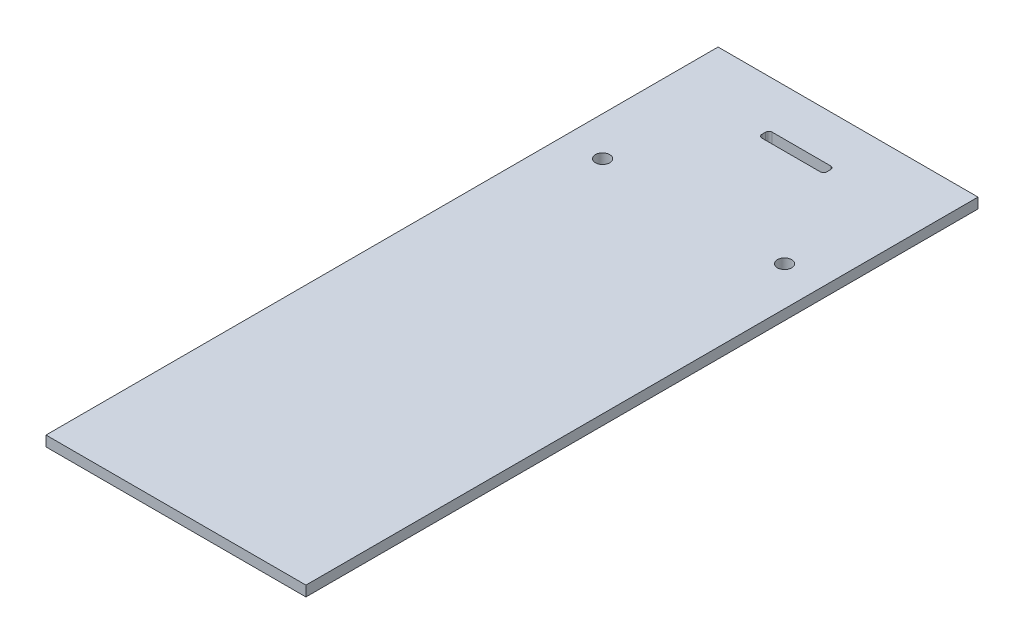
ISO-10303-21;
HEADER;
FILE_DESCRIPTION(('STEP AP214'),'2;1');
FILE_NAME('part.step','',(''),(''),'','','');
FILE_SCHEMA(('AUTOMOTIVE_DESIGN { 1 0 10303 214 1 1 1 1 }'));
ENDSEC;
DATA;
#1=APPLICATION_CONTEXT('core data for automotive mechanical design processes');
#2=APPLICATION_PROTOCOL_DEFINITION('international standard','automotive_design',2000,#1);
#3=PRODUCT_CONTEXT('',#1,'mechanical');
#4=PRODUCT('Part','Part','',(#3));
#5=PRODUCT_RELATED_PRODUCT_CATEGORY('part','',(#4));
#6=PRODUCT_DEFINITION_FORMATION('','',#4);
#7=PRODUCT_DEFINITION_CONTEXT('part definition',#1,'design');
#8=PRODUCT_DEFINITION('design','',#6,#7);
#9=PRODUCT_DEFINITION_SHAPE('','',#8);
#10=(LENGTH_UNIT() NAMED_UNIT(*) SI_UNIT(.MILLI.,.METRE.));
#11=(NAMED_UNIT(*) PLANE_ANGLE_UNIT() SI_UNIT($,.RADIAN.));
#12=(NAMED_UNIT(*) SI_UNIT($,.STERADIAN.) SOLID_ANGLE_UNIT());
#13=UNCERTAINTY_MEASURE_WITH_UNIT(LENGTH_MEASURE(1.E-05),#10,'distance_accuracy_value','');
#14=(GEOMETRIC_REPRESENTATION_CONTEXT(3) GLOBAL_UNCERTAINTY_ASSIGNED_CONTEXT((#13)) GLOBAL_UNIT_ASSIGNED_CONTEXT((#10,
#11,#12)) REPRESENTATION_CONTEXT('',''));
#15=CARTESIAN_POINT('',(0.,0.,0.));
#16=DIRECTION('',(0.,0.,1.));
#17=DIRECTION('',(1.,0.,0.));
#18=AXIS2_PLACEMENT_3D('',#15,#16,#17);
#19=CARTESIAN_POINT('',(40.,3.175,103.425));
#20=DIRECTION('',(-1.,0.,0.));
#21=DIRECTION('',(0.,0.,1.));
#22=AXIS2_PLACEMENT_3D('',#19,#20,#21);
#23=PLANE('',#22);
#24=DIRECTION('',(0.,0.,-1.));
#25=VECTOR('',#24,1.);
#26=CARTESIAN_POINT('',(40.,0.,103.425));
#27=LINE('',#26,#25);
#28=CARTESIAN_POINT('',(40.,0.,103.425));
#29=VERTEX_POINT('',#28);
#30=CARTESIAN_POINT('',(40.,0.,-103.425));
#31=VERTEX_POINT('',#30);
#32=EDGE_CURVE('E160',#29,#31,#27,.T.);
#33=ORIENTED_EDGE('',*,*,#32,.T.);
#34=DIRECTION('',(0.,-1.,0.));
#35=VECTOR('',#34,1.);
#36=CARTESIAN_POINT('',(40.,3.175,-103.425));
#37=LINE('',#36,#35);
#38=CARTESIAN_POINT('',(40.,3.175,-103.425));
#39=VERTEX_POINT('',#38);
#40=EDGE_CURVE('E139',#39,#31,#37,.T.);
#41=ORIENTED_EDGE('',*,*,#40,.F.);
#42=DIRECTION('',(0.,0.,-1.));
#43=VECTOR('',#42,1.);
#44=CARTESIAN_POINT('',(40.,3.175,103.425));
#45=LINE('',#44,#43);
#46=CARTESIAN_POINT('',(40.,3.175,103.425));
#47=VERTEX_POINT('',#46);
#48=EDGE_CURVE('E147',#47,#39,#45,.T.);
#49=ORIENTED_EDGE('',*,*,#48,.F.);
#50=DIRECTION('',(0.,-1.,0.));
#51=VECTOR('',#50,1.);
#52=CARTESIAN_POINT('',(40.,3.175,103.425));
#53=LINE('',#52,#51);
#54=EDGE_CURVE('E277',#47,#29,#53,.T.);
#55=ORIENTED_EDGE('',*,*,#54,.T.);
#56=EDGE_LOOP('',(#33,#41,#49,#55));
#57=FACE_BOUND('',#56,.T.);
#58=ADVANCED_FACE('F45',(#57),#23,.F.);
#59=CARTESIAN_POINT('',(-40.,3.175,-103.425));
#60=DIRECTION('',(0.,0.,1.));
#61=DIRECTION('',(1.,0.,0.));
#62=AXIS2_PLACEMENT_3D('',#59,#60,#61);
#63=PLANE('',#62);
#64=DIRECTION('',(-1.,0.,0.));
#65=VECTOR('',#64,1.);
#66=CARTESIAN_POINT('',(-40.,0.,-103.425));
#67=LINE('',#66,#65);
#68=CARTESIAN_POINT('',(-40.,0.,-103.425));
#69=VERTEX_POINT('',#68);
#70=EDGE_CURVE('E280',#31,#69,#67,.T.);
#71=ORIENTED_EDGE('',*,*,#70,.T.);
#72=DIRECTION('',(0.,-1.,0.));
#73=VECTOR('',#72,1.);
#74=CARTESIAN_POINT('',(-40.,3.175,-103.425));
#75=LINE('',#74,#73);
#76=CARTESIAN_POINT('',(-40.,3.175,-103.425));
#77=VERTEX_POINT('',#76);
#78=EDGE_CURVE('E142',#77,#69,#75,.T.);
#79=ORIENTED_EDGE('',*,*,#78,.F.);
#80=DIRECTION('',(-1.,0.,0.));
#81=VECTOR('',#80,1.);
#82=CARTESIAN_POINT('',(-40.,3.175,-103.425));
#83=LINE('',#82,#81);
#84=EDGE_CURVE('E135',#39,#77,#83,.T.);
#85=ORIENTED_EDGE('',*,*,#84,.F.);
#86=ORIENTED_EDGE('',*,*,#40,.T.);
#87=EDGE_LOOP('',(#71,#79,#85,#86));
#88=FACE_BOUND('',#87,.T.);
#89=ADVANCED_FACE('F137',(#88),#63,.F.);
#90=CARTESIAN_POINT('',(-40.,3.175,103.425));
#91=DIRECTION('',(1.,0.,0.));
#92=DIRECTION('',(0.,0.,-1.));
#93=AXIS2_PLACEMENT_3D('',#90,#91,#92);
#94=PLANE('',#93);
#95=DIRECTION('',(0.,0.,1.));
#96=VECTOR('',#95,1.);
#97=CARTESIAN_POINT('',(-40.,0.,103.425));
#98=LINE('',#97,#96);
#99=CARTESIAN_POINT('',(-40.,0.,103.425));
#100=VERTEX_POINT('',#99);
#101=EDGE_CURVE('E283',#69,#100,#98,.T.);
#102=ORIENTED_EDGE('',*,*,#101,.T.);
#103=DIRECTION('',(0.,-1.,0.));
#104=VECTOR('',#103,1.);
#105=CARTESIAN_POINT('',(-40.,3.175,103.425));
#106=LINE('',#105,#104);
#107=CARTESIAN_POINT('',(-40.,3.175,103.425));
#108=VERTEX_POINT('',#107);
#109=EDGE_CURVE('E168',#108,#100,#106,.T.);
#110=ORIENTED_EDGE('',*,*,#109,.F.);
#111=DIRECTION('',(0.,0.,1.));
#112=VECTOR('',#111,1.);
#113=CARTESIAN_POINT('',(-40.,3.175,103.425));
#114=LINE('',#113,#112);
#115=EDGE_CURVE('E146',#77,#108,#114,.T.);
#116=ORIENTED_EDGE('',*,*,#115,.F.);
#117=ORIENTED_EDGE('',*,*,#78,.T.);
#118=EDGE_LOOP('',(#102,#110,#116,#117));
#119=FACE_BOUND('',#118,.T.);
#120=ADVANCED_FACE('F299',(#119),#94,.F.);
#121=CARTESIAN_POINT('',(-40.,3.175,103.425));
#122=DIRECTION('',(0.,0.,-1.));
#123=DIRECTION('',(-1.,0.,0.));
#124=AXIS2_PLACEMENT_3D('',#121,#122,#123);
#125=PLANE('',#124);
#126=DIRECTION('',(1.,0.,0.));
#127=VECTOR('',#126,1.);
#128=CARTESIAN_POINT('',(-40.,0.,103.425));
#129=LINE('',#128,#127);
#130=EDGE_CURVE('E157',#100,#29,#129,.T.);
#131=ORIENTED_EDGE('',*,*,#130,.T.);
#132=ORIENTED_EDGE('',*,*,#54,.F.);
#133=DIRECTION('',(1.,0.,0.));
#134=VECTOR('',#133,1.);
#135=CARTESIAN_POINT('',(-40.,3.175,103.425));
#136=LINE('',#135,#134);
#137=EDGE_CURVE('E152',#108,#47,#136,.T.);
#138=ORIENTED_EDGE('',*,*,#137,.F.);
#139=ORIENTED_EDGE('',*,*,#109,.T.);
#140=EDGE_LOOP('',(#131,#132,#138,#139));
#141=FACE_BOUND('',#140,.T.);
#142=ADVANCED_FACE('F294',(#141),#125,.F.);
#143=CARTESIAN_POINT('',(0.,3.175,0.));
#144=DIRECTION('',(0.,-1.,0.));
#145=DIRECTION('',(0.,0.,-1.));
#146=AXIS2_PLACEMENT_3D('',#143,#144,#145);
#147=PLANE('',#146);
#148=DIRECTION('',(-1.,0.,0.));
#149=VECTOR('',#148,1.);
#150=CARTESIAN_POINT('',(-10.,3.175,-89.0578365013378));
#151=LINE('',#150,#149);
#152=CARTESIAN_POINT('',(9.,3.175,-89.0578365013378));
#153=VERTEX_POINT('',#152);
#154=CARTESIAN_POINT('',(-9.,3.175,-89.0578365013378));
#155=VERTEX_POINT('',#154);
#156=EDGE_CURVE('E250',#153,#155,#151,.T.);
#157=ORIENTED_EDGE('',*,*,#156,.F.);
#158=CARTESIAN_POINT('',(9.,3.175,-88.0578365013378));
#159=DIRECTION('',(0.,-1.,0.));
#160=DIRECTION('',(0.,0.,-1.));
#161=AXIS2_PLACEMENT_3D('',#158,#159,#160);
#162=CIRCLE('',#161,1.);
#163=CARTESIAN_POINT('',(10.,3.175,-88.0578365013378));
#164=VERTEX_POINT('',#163);
#165=EDGE_CURVE('E207',#153,#164,#162,.T.);
#166=ORIENTED_EDGE('',*,*,#165,.T.);
#167=DIRECTION('',(0.,0.,-1.));
#168=VECTOR('',#167,1.);
#169=CARTESIAN_POINT('',(10.,3.175,-85.8828365013378));
#170=LINE('',#169,#168);
#171=CARTESIAN_POINT('',(10.,3.175,-86.8828365013378));
#172=VERTEX_POINT('',#171);
#173=EDGE_CURVE('E220',#172,#164,#170,.T.);
#174=ORIENTED_EDGE('',*,*,#173,.F.);
#175=CARTESIAN_POINT('',(9.,3.175,-86.8828365013378));
#176=DIRECTION('',(0.,-1.,0.));
#177=DIRECTION('',(0.,0.,-1.));
#178=AXIS2_PLACEMENT_3D('',#175,#176,#177);
#179=CIRCLE('',#178,1.);
#180=CARTESIAN_POINT('',(9.,3.175,-85.8828365013378));
#181=VERTEX_POINT('',#180);
#182=EDGE_CURVE('E54',#172,#181,#179,.T.);
#183=ORIENTED_EDGE('',*,*,#182,.T.);
#184=DIRECTION('',(1.,0.,0.));
#185=VECTOR('',#184,1.);
#186=CARTESIAN_POINT('',(-10.,3.175,-85.8828365013378));
#187=LINE('',#186,#185);
#188=CARTESIAN_POINT('',(-9.,3.175,-85.8828365013378));
#189=VERTEX_POINT('',#188);
#190=EDGE_CURVE('E219',#189,#181,#187,.T.);
#191=ORIENTED_EDGE('',*,*,#190,.F.);
#192=CARTESIAN_POINT('',(-9.,3.175,-86.8828365013378));
#193=DIRECTION('',(0.,-1.,0.));
#194=DIRECTION('',(0.,0.,-1.));
#195=AXIS2_PLACEMENT_3D('',#192,#193,#194);
#196=CIRCLE('',#195,1.);
#197=CARTESIAN_POINT('',(-10.,3.175,-86.8828365013378));
#198=VERTEX_POINT('',#197);
#199=EDGE_CURVE('E195',#189,#198,#196,.T.);
#200=ORIENTED_EDGE('',*,*,#199,.T.);
#201=DIRECTION('',(0.,0.,1.));
#202=VECTOR('',#201,1.);
#203=CARTESIAN_POINT('',(-10.,3.175,-85.8828365013378));
#204=LINE('',#203,#202);
#205=CARTESIAN_POINT('',(-10.,3.175,-88.0578365013378));
#206=VERTEX_POINT('',#205);
#207=EDGE_CURVE('E230',#206,#198,#204,.T.);
#208=ORIENTED_EDGE('',*,*,#207,.F.);
#209=CARTESIAN_POINT('',(-9.,3.175,-88.0578365013378));
#210=DIRECTION('',(0.,-1.,0.));
#211=DIRECTION('',(0.,0.,-1.));
#212=AXIS2_PLACEMENT_3D('',#209,#210,#211);
#213=CIRCLE('',#212,1.);
#214=EDGE_CURVE('E201',#206,#155,#213,.T.);
#215=ORIENTED_EDGE('',*,*,#214,.T.);
#216=EDGE_LOOP('',(#157,#166,#174,#183,#191,#200,#208,#215));
#217=FACE_BOUND('',#216,.T.);
#218=CARTESIAN_POINT('',(28.,3.175,-55.8828365013378));
#219=DIRECTION('',(0.,1.,0.));
#220=DIRECTION('',(0.,0.,1.));
#221=AXIS2_PLACEMENT_3D('',#218,#219,#220);
#222=CIRCLE('',#221,2.2);
#223=CARTESIAN_POINT('',(28.,3.175,-53.6828365013378));
#224=VERTEX_POINT('',#223);
#225=EDGE_CURVE('E251',#224,#224,#222,.T.);
#226=ORIENTED_EDGE('',*,*,#225,.F.);
#227=EDGE_LOOP('',(#226));
#228=FACE_BOUND('',#227,.T.);
#229=CARTESIAN_POINT('',(-28.,3.175,-55.8828365013378));
#230=DIRECTION('',(0.,1.,0.));
#231=DIRECTION('',(0.,0.,-1.));
#232=AXIS2_PLACEMENT_3D('',#229,#230,#231);
#233=CIRCLE('',#232,2.20000000000001);
#234=CARTESIAN_POINT('',(-28.,3.175,-58.0828365013378));
#235=VERTEX_POINT('',#234);
#236=EDGE_CURVE('E265',#235,#235,#233,.T.);
#237=ORIENTED_EDGE('',*,*,#236,.F.);
#238=EDGE_LOOP('',(#237));
#239=FACE_BOUND('',#238,.T.);
#240=ORIENTED_EDGE('',*,*,#48,.T.);
#241=ORIENTED_EDGE('',*,*,#84,.T.);
#242=ORIENTED_EDGE('',*,*,#115,.T.);
#243=ORIENTED_EDGE('',*,*,#137,.T.);
#244=EDGE_LOOP('',(#240,#241,#242,#243));
#245=FACE_BOUND('',#244,.T.);
#246=ADVANCED_FACE('F150',(#217,#228,#239,#245),#147,.F.);
#247=CARTESIAN_POINT('',(0.,0.,0.));
#248=DIRECTION('',(0.,-1.,0.));
#249=DIRECTION('',(0.,0.,-1.));
#250=AXIS2_PLACEMENT_3D('',#247,#248,#249);
#251=PLANE('',#250);
#252=DIRECTION('',(1.,0.,0.));
#253=VECTOR('',#252,1.);
#254=CARTESIAN_POINT('',(-10.,0.,-85.8828365013378));
#255=LINE('',#254,#253);
#256=CARTESIAN_POINT('',(-9.,0.,-85.8828365013378));
#257=VERTEX_POINT('',#256);
#258=CARTESIAN_POINT('',(9.,0.,-85.8828365013378));
#259=VERTEX_POINT('',#258);
#260=EDGE_CURVE('E245',#257,#259,#255,.T.);
#261=ORIENTED_EDGE('',*,*,#260,.T.);
#262=CARTESIAN_POINT('',(9.,0.,-86.8828365013378));
#263=DIRECTION('',(0.,-1.,0.));
#264=DIRECTION('',(0.,0.,-1.));
#265=AXIS2_PLACEMENT_3D('',#262,#263,#264);
#266=CIRCLE('',#265,1.);
#267=CARTESIAN_POINT('',(10.,0.,-86.8828365013378));
#268=VERTEX_POINT('',#267);
#269=EDGE_CURVE('E11',#259,#268,#266,.F.);
#270=ORIENTED_EDGE('',*,*,#269,.T.);
#271=DIRECTION('',(0.,0.,-1.));
#272=VECTOR('',#271,1.);
#273=CARTESIAN_POINT('',(10.,0.,-85.8828365013378));
#274=LINE('',#273,#272);
#275=CARTESIAN_POINT('',(10.,0.,-88.0578365013378));
#276=VERTEX_POINT('',#275);
#277=EDGE_CURVE('E229',#268,#276,#274,.T.);
#278=ORIENTED_EDGE('',*,*,#277,.T.);
#279=CARTESIAN_POINT('',(9.,0.,-88.0578365013378));
#280=DIRECTION('',(0.,-1.,0.));
#281=DIRECTION('',(0.,0.,-1.));
#282=AXIS2_PLACEMENT_3D('',#279,#280,#281);
#283=CIRCLE('',#282,1.);
#284=CARTESIAN_POINT('',(9.,0.,-89.0578365013378));
#285=VERTEX_POINT('',#284);
#286=EDGE_CURVE('E210',#276,#285,#283,.F.);
#287=ORIENTED_EDGE('',*,*,#286,.T.);
#288=DIRECTION('',(-1.,0.,0.));
#289=VECTOR('',#288,1.);
#290=CARTESIAN_POINT('',(-10.,0.,-89.0578365013378));
#291=LINE('',#290,#289);
#292=CARTESIAN_POINT('',(-9.,0.,-89.0578365013378));
#293=VERTEX_POINT('',#292);
#294=EDGE_CURVE('E235',#285,#293,#291,.T.);
#295=ORIENTED_EDGE('',*,*,#294,.T.);
#296=CARTESIAN_POINT('',(-9.,0.,-88.0578365013378));
#297=DIRECTION('',(0.,-1.,0.));
#298=DIRECTION('',(0.,0.,-1.));
#299=AXIS2_PLACEMENT_3D('',#296,#297,#298);
#300=CIRCLE('',#299,1.);
#301=CARTESIAN_POINT('',(-10.,0.,-88.0578365013378));
#302=VERTEX_POINT('',#301);
#303=EDGE_CURVE('E204',#293,#302,#300,.F.);
#304=ORIENTED_EDGE('',*,*,#303,.T.);
#305=DIRECTION('',(0.,0.,1.));
#306=VECTOR('',#305,1.);
#307=CARTESIAN_POINT('',(-10.,0.,-85.8828365013378));
#308=LINE('',#307,#306);
#309=CARTESIAN_POINT('',(-10.,0.,-86.8828365013378));
#310=VERTEX_POINT('',#309);
#311=EDGE_CURVE('E239',#302,#310,#308,.T.);
#312=ORIENTED_EDGE('',*,*,#311,.T.);
#313=CARTESIAN_POINT('',(-9.,0.,-86.8828365013378));
#314=DIRECTION('',(0.,-1.,0.));
#315=DIRECTION('',(0.,0.,-1.));
#316=AXIS2_PLACEMENT_3D('',#313,#314,#315);
#317=CIRCLE('',#316,1.);
#318=EDGE_CURVE('E198',#310,#257,#317,.F.);
#319=ORIENTED_EDGE('',*,*,#318,.T.);
#320=EDGE_LOOP('',(#261,#270,#278,#287,#295,#304,#312,#319));
#321=FACE_BOUND('',#320,.T.);
#322=CARTESIAN_POINT('',(28.,0.,-55.8828365013378));
#323=DIRECTION('',(0.,1.,0.));
#324=DIRECTION('',(0.,0.,1.));
#325=AXIS2_PLACEMENT_3D('',#322,#323,#324);
#326=CIRCLE('',#325,2.2);
#327=CARTESIAN_POINT('',(28.,0.,-53.6828365013378));
#328=VERTEX_POINT('',#327);
#329=EDGE_CURVE('E261',#328,#328,#326,.T.);
#330=ORIENTED_EDGE('',*,*,#329,.T.);
#331=EDGE_LOOP('',(#330));
#332=FACE_BOUND('',#331,.T.);
#333=CARTESIAN_POINT('',(-28.,0.,-55.8828365013378));
#334=DIRECTION('',(0.,1.,0.));
#335=DIRECTION('',(0.,0.,-1.));
#336=AXIS2_PLACEMENT_3D('',#333,#334,#335);
#337=CIRCLE('',#336,2.20000000000001);
#338=CARTESIAN_POINT('',(-28.,0.,-58.0828365013378));
#339=VERTEX_POINT('',#338);
#340=EDGE_CURVE('E269',#339,#339,#337,.T.);
#341=ORIENTED_EDGE('',*,*,#340,.T.);
#342=EDGE_LOOP('',(#341));
#343=FACE_BOUND('',#342,.T.);
#344=ORIENTED_EDGE('',*,*,#32,.F.);
#345=ORIENTED_EDGE('',*,*,#130,.F.);
#346=ORIENTED_EDGE('',*,*,#101,.F.);
#347=ORIENTED_EDGE('',*,*,#70,.F.);
#348=EDGE_LOOP('',(#344,#345,#346,#347));
#349=FACE_BOUND('',#348,.T.);
#350=ADVANCED_FACE('F298',(#321,#332,#343,#349),#251,.T.);
#351=CARTESIAN_POINT('',(-28.,0.,-55.8828365013378));
#352=DIRECTION('',(0.,1.,0.));
#353=DIRECTION('',(0.,0.,1.));
#354=AXIS2_PLACEMENT_3D('',#351,#352,#353);
#355=CYLINDRICAL_SURFACE('',#354,2.20000000000001);
#356=ORIENTED_EDGE('',*,*,#340,.F.);
#357=EDGE_LOOP('',(#356));
#358=FACE_BOUND('',#357,.T.);
#359=ORIENTED_EDGE('',*,*,#236,.T.);
#360=EDGE_LOOP('',(#359));
#361=FACE_BOUND('',#360,.T.);
#362=ADVANCED_FACE('F354',(#358,#361),#355,.F.);
#363=CARTESIAN_POINT('',(28.,0.,-55.8828365013378));
#364=DIRECTION('',(0.,1.,0.));
#365=DIRECTION('',(0.,0.,1.));
#366=AXIS2_PLACEMENT_3D('',#363,#364,#365);
#367=CYLINDRICAL_SURFACE('',#366,2.2);
#368=ORIENTED_EDGE('',*,*,#329,.F.);
#369=EDGE_LOOP('',(#368));
#370=FACE_BOUND('',#369,.T.);
#371=ORIENTED_EDGE('',*,*,#225,.T.);
#372=EDGE_LOOP('',(#371));
#373=FACE_BOUND('',#372,.T.);
#374=ADVANCED_FACE('F351',(#370,#373),#367,.F.);
#375=CARTESIAN_POINT('',(10.,0.,-85.8828365013378));
#376=DIRECTION('',(1.,0.,0.));
#377=DIRECTION('',(0.,0.,-1.));
#378=AXIS2_PLACEMENT_3D('',#375,#376,#377);
#379=PLANE('',#378);
#380=ORIENTED_EDGE('',*,*,#173,.T.);
#381=DIRECTION('',(0.,1.,0.));
#382=VECTOR('',#381,1.);
#383=CARTESIAN_POINT('',(10.,0.,-88.0578365013378));
#384=LINE('',#383,#382);
#385=EDGE_CURVE('E61',#164,#276,#384,.F.);
#386=ORIENTED_EDGE('',*,*,#385,.T.);
#387=ORIENTED_EDGE('',*,*,#277,.F.);
#388=DIRECTION('',(0.,1.,0.));
#389=VECTOR('',#388,1.);
#390=CARTESIAN_POINT('',(10.,3.175,-86.8828365013378));
#391=LINE('',#390,#389);
#392=EDGE_CURVE('E189',#268,#172,#391,.T.);
#393=ORIENTED_EDGE('',*,*,#392,.T.);
#394=EDGE_LOOP('',(#380,#386,#387,#393));
#395=FACE_BOUND('',#394,.T.);
#396=ADVANCED_FACE('F232',(#395),#379,.F.);
#397=CARTESIAN_POINT('',(-10.,0.,-85.8828365013378));
#398=DIRECTION('',(0.,0.,1.));
#399=DIRECTION('',(1.,0.,0.));
#400=AXIS2_PLACEMENT_3D('',#397,#398,#399);
#401=PLANE('',#400);
#402=ORIENTED_EDGE('',*,*,#260,.F.);
#403=DIRECTION('',(0.,1.,0.));
#404=VECTOR('',#403,1.);
#405=CARTESIAN_POINT('',(-9.,3.175,-85.8828365013378));
#406=LINE('',#405,#404);
#407=EDGE_CURVE('E166',#257,#189,#406,.T.);
#408=ORIENTED_EDGE('',*,*,#407,.T.);
#409=ORIENTED_EDGE('',*,*,#190,.T.);
#410=DIRECTION('',(0.,1.,0.));
#411=VECTOR('',#410,1.);
#412=CARTESIAN_POINT('',(9.,0.,-85.8828365013378));
#413=LINE('',#412,#411);
#414=EDGE_CURVE('E162',#181,#259,#413,.F.);
#415=ORIENTED_EDGE('',*,*,#414,.T.);
#416=EDGE_LOOP('',(#402,#408,#409,#415));
#417=FACE_BOUND('',#416,.T.);
#418=ADVANCED_FACE('F226',(#417),#401,.F.);
#419=CARTESIAN_POINT('',(-10.,0.,-85.8828365013378));
#420=DIRECTION('',(-1.,0.,0.));
#421=DIRECTION('',(0.,0.,1.));
#422=AXIS2_PLACEMENT_3D('',#419,#420,#421);
#423=PLANE('',#422);
#424=ORIENTED_EDGE('',*,*,#207,.T.);
#425=DIRECTION('',(0.,1.,0.));
#426=VECTOR('',#425,1.);
#427=CARTESIAN_POINT('',(-10.,0.,-86.8828365013378));
#428=LINE('',#427,#426);
#429=EDGE_CURVE('E179',#198,#310,#428,.F.);
#430=ORIENTED_EDGE('',*,*,#429,.T.);
#431=ORIENTED_EDGE('',*,*,#311,.F.);
#432=DIRECTION('',(0.,1.,0.));
#433=VECTOR('',#432,1.);
#434=CARTESIAN_POINT('',(-10.,3.175,-88.0578365013378));
#435=LINE('',#434,#433);
#436=EDGE_CURVE('E175',#302,#206,#435,.T.);
#437=ORIENTED_EDGE('',*,*,#436,.T.);
#438=EDGE_LOOP('',(#424,#430,#431,#437));
#439=FACE_BOUND('',#438,.T.);
#440=ADVANCED_FACE('F337',(#439),#423,.F.);
#441=CARTESIAN_POINT('',(-10.,0.,-89.0578365013378));
#442=DIRECTION('',(0.,0.,-1.));
#443=DIRECTION('',(-1.,0.,0.));
#444=AXIS2_PLACEMENT_3D('',#441,#442,#443);
#445=PLANE('',#444);
#446=ORIENTED_EDGE('',*,*,#156,.T.);
#447=DIRECTION('',(0.,1.,0.));
#448=VECTOR('',#447,1.);
#449=CARTESIAN_POINT('',(-9.,0.,-89.0578365013378));
#450=LINE('',#449,#448);
#451=EDGE_CURVE('E186',#155,#293,#450,.F.);
#452=ORIENTED_EDGE('',*,*,#451,.T.);
#453=ORIENTED_EDGE('',*,*,#294,.F.);
#454=DIRECTION('',(0.,1.,0.));
#455=VECTOR('',#454,1.);
#456=CARTESIAN_POINT('',(9.,3.175,-89.0578365013378));
#457=LINE('',#456,#455);
#458=EDGE_CURVE('E182',#285,#153,#457,.T.);
#459=ORIENTED_EDGE('',*,*,#458,.T.);
#460=EDGE_LOOP('',(#446,#452,#453,#459));
#461=FACE_BOUND('',#460,.T.);
#462=ADVANCED_FACE('F317',(#461),#445,.F.);
#463=CARTESIAN_POINT('',(-9.,0.,-86.8828365013378));
#464=DIRECTION('',(0.,-1.,0.));
#465=DIRECTION('',(0.,0.,-1.));
#466=AXIS2_PLACEMENT_3D('',#463,#464,#465);
#467=CYLINDRICAL_SURFACE('',#466,1.);
#468=ORIENTED_EDGE('',*,*,#318,.F.);
#469=ORIENTED_EDGE('',*,*,#429,.F.);
#470=ORIENTED_EDGE('',*,*,#199,.F.);
#471=ORIENTED_EDGE('',*,*,#407,.F.);
#472=EDGE_LOOP('',(#468,#469,#470,#471));
#473=FACE_BOUND('',#472,.T.);
#474=ADVANCED_FACE('F313',(#473),#467,.F.);
#475=CARTESIAN_POINT('',(-9.,0.,-88.0578365013378));
#476=DIRECTION('',(0.,-1.,0.));
#477=DIRECTION('',(0.,0.,-1.));
#478=AXIS2_PLACEMENT_3D('',#475,#476,#477);
#479=CYLINDRICAL_SURFACE('',#478,1.);
#480=ORIENTED_EDGE('',*,*,#303,.F.);
#481=ORIENTED_EDGE('',*,*,#451,.F.);
#482=ORIENTED_EDGE('',*,*,#214,.F.);
#483=ORIENTED_EDGE('',*,*,#436,.F.);
#484=EDGE_LOOP('',(#480,#481,#482,#483));
#485=FACE_BOUND('',#484,.T.);
#486=ADVANCED_FACE('F316',(#485),#479,.F.);
#487=CARTESIAN_POINT('',(9.,0.,-88.0578365013378));
#488=DIRECTION('',(0.,-1.,0.));
#489=DIRECTION('',(0.,0.,-1.));
#490=AXIS2_PLACEMENT_3D('',#487,#488,#489);
#491=CYLINDRICAL_SURFACE('',#490,1.);
#492=ORIENTED_EDGE('',*,*,#286,.F.);
#493=ORIENTED_EDGE('',*,*,#385,.F.);
#494=ORIENTED_EDGE('',*,*,#165,.F.);
#495=ORIENTED_EDGE('',*,*,#458,.F.);
#496=EDGE_LOOP('',(#492,#493,#494,#495));
#497=FACE_BOUND('',#496,.T.);
#498=ADVANCED_FACE('F320',(#497),#491,.F.);
#499=CARTESIAN_POINT('',(9.,0.,-86.8828365013378));
#500=DIRECTION('',(0.,-1.,0.));
#501=DIRECTION('',(0.,0.,-1.));
#502=AXIS2_PLACEMENT_3D('',#499,#500,#501);
#503=CYLINDRICAL_SURFACE('',#502,1.);
#504=ORIENTED_EDGE('',*,*,#269,.F.);
#505=ORIENTED_EDGE('',*,*,#414,.F.);
#506=ORIENTED_EDGE('',*,*,#182,.F.);
#507=ORIENTED_EDGE('',*,*,#392,.F.);
#508=EDGE_LOOP('',(#504,#505,#506,#507));
#509=FACE_BOUND('',#508,.T.);
#510=ADVANCED_FACE('F47',(#509),#503,.F.);
#511=CLOSED_SHELL('',(#58,#89,#120,#142,#246,#350,#362,#374,#396,#418,#440,#462,#474,#486,#498,#510));
#512=MANIFOLD_SOLID_BREP('B2',#511);
#513=ADVANCED_BREP_SHAPE_REPRESENTATION('',(#18,#512),#14);
#514=SHAPE_DEFINITION_REPRESENTATION(#9,#513);
ENDSEC;
END-ISO-10303-21;
